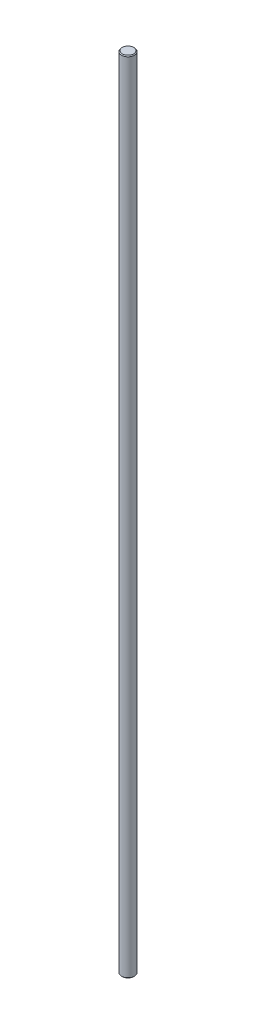
ISO-10303-21;
HEADER;
FILE_DESCRIPTION(('STEP AP214'),'2;1');
FILE_NAME('part.step','',(''),(''),'','','');
FILE_SCHEMA(('AUTOMOTIVE_DESIGN { 1 0 10303 214 1 1 1 1 }'));
ENDSEC;
DATA;
#1=APPLICATION_CONTEXT('core data for automotive mechanical design processes');
#2=APPLICATION_PROTOCOL_DEFINITION('international standard','automotive_design',2000,#1);
#3=PRODUCT_CONTEXT('',#1,'mechanical');
#4=PRODUCT('Part','Part','',(#3));
#5=PRODUCT_RELATED_PRODUCT_CATEGORY('part','',(#4));
#6=PRODUCT_DEFINITION_FORMATION('','',#4);
#7=PRODUCT_DEFINITION_CONTEXT('part definition',#1,'design');
#8=PRODUCT_DEFINITION('design','',#6,#7);
#9=PRODUCT_DEFINITION_SHAPE('','',#8);
#10=(LENGTH_UNIT() NAMED_UNIT(*) SI_UNIT(.MILLI.,.METRE.));
#11=(NAMED_UNIT(*) PLANE_ANGLE_UNIT() SI_UNIT($,.RADIAN.));
#12=(NAMED_UNIT(*) SI_UNIT($,.STERADIAN.) SOLID_ANGLE_UNIT());
#13=UNCERTAINTY_MEASURE_WITH_UNIT(LENGTH_MEASURE(1.E-05),#10,'distance_accuracy_value','');
#14=(GEOMETRIC_REPRESENTATION_CONTEXT(3) GLOBAL_UNCERTAINTY_ASSIGNED_CONTEXT((#13)) GLOBAL_UNIT_ASSIGNED_CONTEXT((#10,
#11,#12)) REPRESENTATION_CONTEXT('',''));
#15=CARTESIAN_POINT('',(0.,0.,0.));
#16=DIRECTION('',(0.,0.,1.));
#17=DIRECTION('',(1.,0.,0.));
#18=AXIS2_PLACEMENT_3D('',#15,#16,#17);
#19=CARTESIAN_POINT('',(0.,495.3,0.));
#20=DIRECTION('',(0.,-1.,0.));
#21=DIRECTION('',(0.,0.,-1.));
#22=AXIS2_PLACEMENT_3D('',#19,#20,#21);
#23=CYLINDRICAL_SURFACE('',#22,4.);
#24=CARTESIAN_POINT('',(0.,0.500000000000111,0.));
#25=DIRECTION('',(0.,1.,0.));
#26=DIRECTION('',(0.,0.,1.));
#27=AXIS2_PLACEMENT_3D('',#24,#25,#26);
#28=CIRCLE('',#27,4.);
#29=CARTESIAN_POINT('',(0.,0.500000000000111,4.));
#30=VERTEX_POINT('',#29);
#31=EDGE_CURVE('E42',#30,#30,#28,.T.);
#32=ORIENTED_EDGE('',*,*,#31,.T.);
#33=EDGE_LOOP('',(#32));
#34=FACE_BOUND('',#33,.T.);
#35=CARTESIAN_POINT('',(0.,494.8,0.));
#36=DIRECTION('',(0.,1.,0.));
#37=DIRECTION('',(0.,0.,1.));
#38=AXIS2_PLACEMENT_3D('',#35,#36,#37);
#39=CIRCLE('',#38,4.);
#40=CARTESIAN_POINT('',(0.,494.8,4.));
#41=VERTEX_POINT('',#40);
#42=EDGE_CURVE('E46',#41,#41,#39,.F.);
#43=ORIENTED_EDGE('',*,*,#42,.T.);
#44=EDGE_LOOP('',(#43));
#45=FACE_BOUND('',#44,.T.);
#46=ADVANCED_FACE('F31',(#34,#45),#23,.T.);
#47=CARTESIAN_POINT('',(0.,495.3,0.));
#48=DIRECTION('',(0.,1.,0.));
#49=DIRECTION('',(0.,0.,1.));
#50=AXIS2_PLACEMENT_3D('',#47,#48,#49);
#51=PLANE('',#50);
#52=CARTESIAN_POINT('',(0.,495.3,0.));
#53=DIRECTION('',(0.,1.,0.));
#54=DIRECTION('',(0.,0.,1.));
#55=AXIS2_PLACEMENT_3D('',#52,#53,#54);
#56=CIRCLE('',#55,3.49999999999989);
#57=CARTESIAN_POINT('',(0.,495.3,3.49999999999989));
#58=VERTEX_POINT('',#57);
#59=EDGE_CURVE('E10',#58,#58,#56,.T.);
#60=ORIENTED_EDGE('',*,*,#59,.T.);
#61=EDGE_LOOP('',(#60));
#62=FACE_BOUND('',#61,.T.);
#63=ADVANCED_FACE('F62',(#62),#51,.T.);
#64=CARTESIAN_POINT('',(0.,0.,0.));
#65=DIRECTION('',(0.,1.,0.));
#66=DIRECTION('',(0.,0.,1.));
#67=AXIS2_PLACEMENT_3D('',#64,#65,#66);
#68=PLANE('',#67);
#69=CARTESIAN_POINT('',(0.,0.,0.));
#70=DIRECTION('',(0.,1.,0.));
#71=DIRECTION('',(0.,0.,1.));
#72=AXIS2_PLACEMENT_3D('',#69,#70,#71);
#73=CIRCLE('',#72,3.49999999999995);
#74=CARTESIAN_POINT('',(0.,0.,3.49999999999995));
#75=VERTEX_POINT('',#74);
#76=EDGE_CURVE('E38',#75,#75,#73,.F.);
#77=ORIENTED_EDGE('',*,*,#76,.T.);
#78=EDGE_LOOP('',(#77));
#79=FACE_BOUND('',#78,.T.);
#80=ADVANCED_FACE('F59',(#79),#68,.F.);
#81=CARTESIAN_POINT('',(0.,0.500000000000111,0.));
#82=DIRECTION('',(0.,1.,0.));
#83=DIRECTION('',(0.,0.,1.));
#84=AXIS2_PLACEMENT_3D('',#81,#82,#83);
#85=CONICAL_SURFACE('',#84,4.,0.785398163397389);
#86=ORIENTED_EDGE('',*,*,#76,.F.);
#87=EDGE_LOOP('',(#86));
#88=FACE_BOUND('',#87,.T.);
#89=ORIENTED_EDGE('',*,*,#31,.F.);
#90=EDGE_LOOP('',(#89));
#91=FACE_BOUND('',#90,.T.);
#92=ADVANCED_FACE('F55',(#88,#91),#85,.T.);
#93=CARTESIAN_POINT('',(0.,495.3,0.));
#94=DIRECTION('',(0.,-1.,0.));
#95=DIRECTION('',(0.,0.,-1.));
#96=AXIS2_PLACEMENT_3D('',#93,#94,#95);
#97=CONICAL_SURFACE('',#96,3.49999999999989,0.7853981633975);
#98=ORIENTED_EDGE('',*,*,#42,.F.);
#99=EDGE_LOOP('',(#98));
#100=FACE_BOUND('',#99,.T.);
#101=ORIENTED_EDGE('',*,*,#59,.F.);
#102=EDGE_LOOP('',(#101));
#103=FACE_BOUND('',#102,.T.);
#104=ADVANCED_FACE('F33',(#100,#103),#97,.T.);
#105=CLOSED_SHELL('',(#46,#63,#80,#92,#104));
#106=MANIFOLD_SOLID_BREP('B2',#105);
#107=ADVANCED_BREP_SHAPE_REPRESENTATION('',(#18,#106),#14);
#108=SHAPE_DEFINITION_REPRESENTATION(#9,#107);
ENDSEC;
END-ISO-10303-21;
